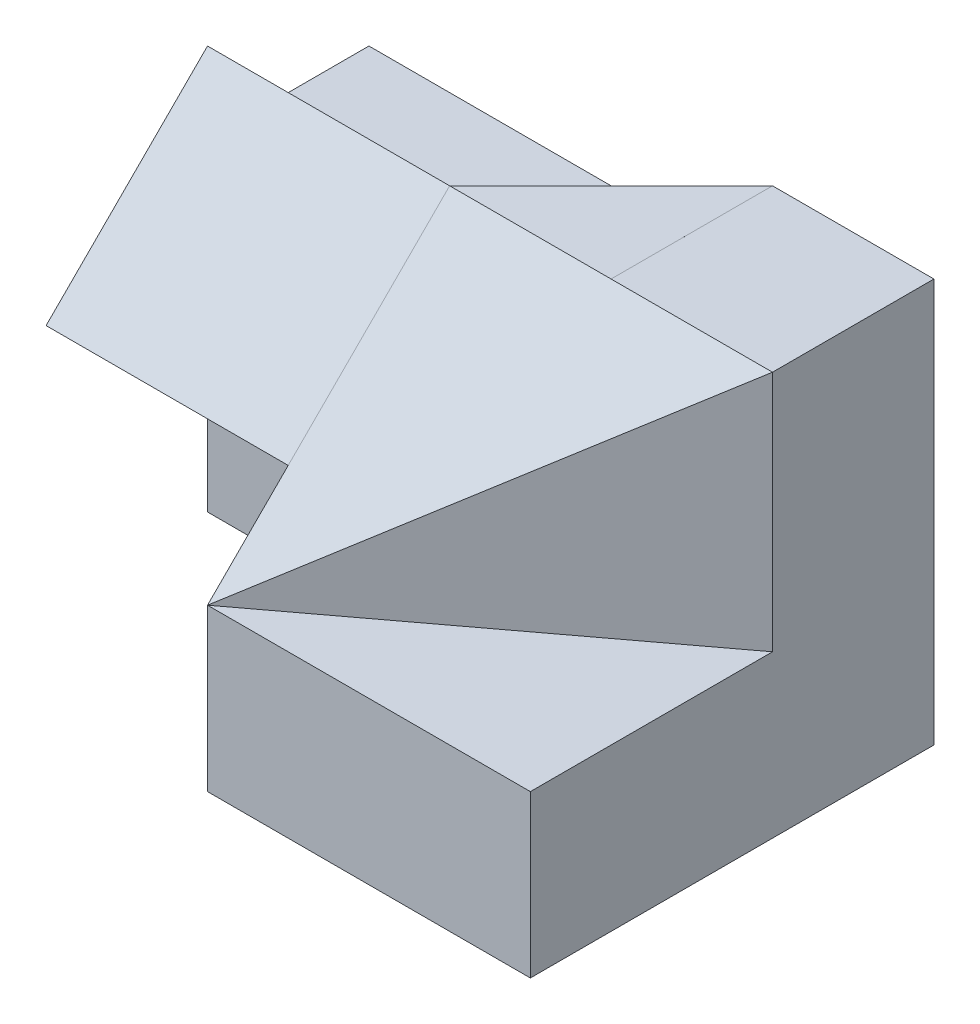
ISO-10303-21;
HEADER;
FILE_DESCRIPTION(('STEP AP214'),'2;1');
FILE_NAME('part.step','',(''),(''),'','','');
FILE_SCHEMA(('AUTOMOTIVE_DESIGN { 1 0 10303 214 1 1 1 1 }'));
ENDSEC;
DATA;
#1=APPLICATION_CONTEXT('core data for automotive mechanical design processes');
#2=APPLICATION_PROTOCOL_DEFINITION('international standard','automotive_design',2000,#1);
#3=PRODUCT_CONTEXT('',#1,'mechanical');
#4=PRODUCT('Part','Part','',(#3));
#5=PRODUCT_RELATED_PRODUCT_CATEGORY('part','',(#4));
#6=PRODUCT_DEFINITION_FORMATION('','',#4);
#7=PRODUCT_DEFINITION_CONTEXT('part definition',#1,'design');
#8=PRODUCT_DEFINITION('design','',#6,#7);
#9=PRODUCT_DEFINITION_SHAPE('','',#8);
#10=(LENGTH_UNIT() NAMED_UNIT(*) SI_UNIT(.MILLI.,.METRE.));
#11=(NAMED_UNIT(*) PLANE_ANGLE_UNIT() SI_UNIT($,.RADIAN.));
#12=(NAMED_UNIT(*) SI_UNIT($,.STERADIAN.) SOLID_ANGLE_UNIT());
#13=UNCERTAINTY_MEASURE_WITH_UNIT(LENGTH_MEASURE(1.E-05),#10,'distance_accuracy_value','');
#14=(GEOMETRIC_REPRESENTATION_CONTEXT(3) GLOBAL_UNCERTAINTY_ASSIGNED_CONTEXT((#13)) GLOBAL_UNIT_ASSIGNED_CONTEXT((#10,
#11,#12)) REPRESENTATION_CONTEXT('',''));
#15=CARTESIAN_POINT('',(0.,0.,0.));
#16=DIRECTION('',(0.,0.,1.));
#17=DIRECTION('',(1.,0.,0.));
#18=AXIS2_PLACEMENT_3D('',#15,#16,#17);
#19=CARTESIAN_POINT('',(83.9999999999885,49.9999136,20.0000000001036));
#20=DIRECTION('',(-1.13136949312756E-06,-0.707106781186095,-0.707106781186095));
#21=DIRECTION('',(0.,0.707106781186547,-0.707106781186548));
#22=AXIS2_PLACEMENT_3D('',#19,#20,#21);
#23=PLANE('',#22);
#24=DIRECTION('',(-0.99999999999872,1.60000000012492E-06,-1.91888977700286E-12));
#25=VECTOR('',#24,1.);
#26=CARTESIAN_POINT('',(83.9999999999885,49.9999136,20.0000000001036));
#27=LINE('',#26,#25);
#28=CARTESIAN_POINT('',(49.9999999999744,49.999968,20.0000000000384));
#29=VERTEX_POINT('',#28);
#30=CARTESIAN_POINT('',(30.0000000000288,49.999995499186,20.0000180032562));
#31=VERTEX_POINT('',#30);
#32=EDGE_CURVE('E269',#29,#31,#27,.T.);
#33=ORIENTED_EDGE('',*,*,#32,.T.);
#34=DIRECTION('',(0.999999999996471,-2.49983611112637E-06,8.99838029894826E-07));
#35=VECTOR('',#34,1.);
#36=CARTESIAN_POINT('',(83.9999999997621,49.9998470055938,20.0000665945098));
#37=LINE('',#36,#35);
#38=CARTESIAN_POINT('',(49.9999760000032,49.999932,20.0000359999952));
#39=VERTEX_POINT('',#38);
#40=EDGE_CURVE('E217',#31,#39,#37,.T.);
#41=ORIENTED_EDGE('',*,*,#40,.T.);
#42=DIRECTION('',(0.4264016187771,0.639601745923878,-0.63960242816565));
#43=VECTOR('',#42,1.);
#44=CARTESIAN_POINT('',(30.,20.,50.));
#45=LINE('',#44,#43);
#46=EDGE_CURVE('E445',#39,#29,#45,.T.);
#47=ORIENTED_EDGE('',*,*,#46,.T.);
#48=EDGE_LOOP('',(#33,#41,#47));
#49=FACE_BOUND('',#48,.T.);
#50=ADVANCED_FACE('F35',(#49),#23,.F.);
#51=CARTESIAN_POINT('',(58.,49.9999,4.));
#52=DIRECTION('',(-1.60000000012608E-06,-0.999999999998,1.19999999992108E-06));
#53=DIRECTION('',(0.99999999999872,-1.60000000012723E-06,0.));
#54=AXIS2_PLACEMENT_3D('',#51,#52,#53);
#55=PLANE('',#54);
#56=DIRECTION('',(0.99999999999872,-1.60000000012723E-06,0.));
#57=VECTOR('',#56,1.);
#58=CARTESIAN_POINT('',(58.0000000000308,49.9999192,20.));
#59=LINE('',#58,#57);
#60=CARTESIAN_POINT('',(50.,49.999932,20.));
#61=VERTEX_POINT('',#60);
#62=CARTESIAN_POINT('',(69.9999999998656,49.9999,20.));
#63=VERTEX_POINT('',#62);
#64=EDGE_CURVE('E243',#61,#63,#59,.T.);
#65=ORIENTED_EDGE('',*,*,#64,.F.);
#66=DIRECTION('',(0.554700196224243,-1.88598066717047E-06,-0.832050294336364));
#67=VECTOR('',#66,1.);
#68=CARTESIAN_POINT('',(30.0000313846154,49.9999999998933,49.9999529230769));
#69=LINE('',#68,#67);
#70=EDGE_CURVE('E280',#39,#61,#69,.T.);
#71=ORIENTED_EDGE('',*,*,#70,.F.);
#72=DIRECTION('',(0.99999999999872,-1.60000000012492E-06,1.91888977687061E-12));
#73=VECTOR('',#72,1.);
#74=CARTESIAN_POINT('',(58.,49.9999192000432,20.0000360000106));
#75=LINE('',#74,#73);
#76=CARTESIAN_POINT('',(69.9999519999553,49.99990000012,20.0000360000336));
#77=VERTEX_POINT('',#76);
#78=EDGE_CURVE('E447',#39,#77,#75,.T.);
#79=ORIENTED_EDGE('',*,*,#78,.T.);
#80=DIRECTION('',(0.7999999999984,-2.00000000005351E-06,-0.5999999999988));
#81=VECTOR('',#80,1.);
#82=CARTESIAN_POINT('',(70.,49.9999,20.));
#83=LINE('',#82,#81);
#84=EDGE_CURVE('E453',#77,#63,#83,.T.);
#85=ORIENTED_EDGE('',*,*,#84,.T.);
#86=EDGE_LOOP('',(#65,#71,#79,#85));
#87=FACE_BOUND('',#86,.T.);
#88=ADVANCED_FACE('F389',(#87),#55,.F.);
#89=ORIENTED_EDGE('',*,*,#78,.F.);
#90=DIRECTION('',(-0.426401618777099,-0.639601745923878,0.63960242816565));
#91=VECTOR('',#90,1.);
#92=CARTESIAN_POINT('',(56.1818087404533,59.2726712198362,10.7272868893201));
#93=LINE('',#92,#91);
#94=CARTESIAN_POINT('',(49.9999546665927,49.9999,20.0000680001109));
#95=VERTEX_POINT('',#94);
#96=EDGE_CURVE('E204',#39,#95,#93,.T.);
#97=ORIENTED_EDGE('',*,*,#96,.T.);
#98=DIRECTION('',(0.99999999999872,0.,-1.59999808123515E-06));
#99=VECTOR('',#98,1.);
#100=CARTESIAN_POINT('',(84.0000000000103,49.9999,20.0000136001036));
#101=LINE('',#100,#99);
#102=CARTESIAN_POINT('',(30.,49.9999,20.0001));
#103=VERTEX_POINT('',#102);
#104=EDGE_CURVE('E196',#103,#95,#101,.T.);
#105=ORIENTED_EDGE('',*,*,#104,.F.);
#106=DIRECTION('',(0.,0.707106781186547,-0.707106781186548));
#107=VECTOR('',#106,1.);
#108=CARTESIAN_POINT('',(30.,35.,35.));
#109=LINE('',#108,#107);
#110=CARTESIAN_POINT('',(30.,44.999997000028,25.000002999972));
#111=VERTEX_POINT('',#110);
#112=EDGE_CURVE('E332',#111,#103,#109,.T.);
#113=ORIENTED_EDGE('',*,*,#112,.F.);
#114=CARTESIAN_POINT('',(29.9999680000192,30.,40.));
#115=DIRECTION('',(1.13137220669536E-06,0.707106781186095,-0.707106781186095));
#116=VECTOR('',#115,1.);
#117=LINE('',#114,#116);
#118=CARTESIAN_POINT('',(29.9999880000072,30.,40.0000000000128));
#119=VERTEX_POINT('',#118);
#120=EDGE_CURVE('E359',#119,#111,#117,.T.);
#121=ORIENTED_EDGE('',*,*,#120,.F.);
#122=DIRECTION('',(0.,-0.707106752938031,0.707106809435063));
#123=VECTOR('',#122,1.);
#124=CARTESIAN_POINT('',(30.,35.000000398484,34.9999976020236));
#125=LINE('',#124,#123);
#126=CARTESIAN_POINT('',(30.,20.,50.));
#127=VERTEX_POINT('',#126);
#128=EDGE_CURVE('E44',#119,#127,#125,.T.);
#129=ORIENTED_EDGE('',*,*,#128,.T.);
#130=DIRECTION('',(0.685994727954525,0.514494948375645,-0.514496045965894));
#131=VECTOR('',#130,1.);
#132=CARTESIAN_POINT('',(26.470599307962,17.3529551280058,52.6470505190286));
#133=LINE('',#132,#131);
#134=EDGE_CURVE('E268',#127,#77,#133,.T.);
#135=ORIENTED_EDGE('',*,*,#134,.T.);
#136=EDGE_LOOP('',(#89,#97,#105,#113,#121,#129,#135));
#137=FACE_BOUND('',#136,.T.);
#138=ADVANCED_FACE('F378',(#137),#23,.F.);
#139=CARTESIAN_POINT('',(0.,0.,50.));
#140=DIRECTION('',(0.,0.,-1.));
#141=DIRECTION('',(-1.,0.,0.));
#142=AXIS2_PLACEMENT_3D('',#139,#140,#141);
#143=PLANE('',#142);
#144=DIRECTION('',(-0.99999999999872,1.60000000012492E-06,-1.91888977700286E-12));
#145=VECTOR('',#144,1.);
#146=CARTESIAN_POINT('',(83.9999519999309,19.9999136000768,50.0000000001036));
#147=LINE('',#146,#145);
#148=CARTESIAN_POINT('',(70.,19.999936,50.0000000000768));
#149=VERTEX_POINT('',#148);
#150=CARTESIAN_POINT('',(31.,19.9999991989908,50.));
#151=VERTEX_POINT('',#150);
#152=EDGE_CURVE('E264',#149,#151,#147,.T.);
#153=ORIENTED_EDGE('',*,*,#152,.T.);
#154=DIRECTION('',(1.,0.,0.));
#155=VECTOR('',#154,1.);
#156=CARTESIAN_POINT('',(1.,19.9999991989908,50.));
#157=LINE('',#156,#155);
#158=EDGE_CURVE('E283',#127,#151,#157,.T.);
#159=ORIENTED_EDGE('',*,*,#158,.F.);
#160=DIRECTION('',(0.,1.,0.));
#161=VECTOR('',#160,1.);
#162=CARTESIAN_POINT('',(30.,0.,50.));
#163=LINE('',#162,#161);
#164=CARTESIAN_POINT('',(30.,0.,50.));
#165=VERTEX_POINT('',#164);
#166=EDGE_CURVE('E245',#165,#127,#163,.T.);
#167=ORIENTED_EDGE('',*,*,#166,.F.);
#168=DIRECTION('',(1.,0.,0.));
#169=VECTOR('',#168,1.);
#170=CARTESIAN_POINT('',(0.,0.,50.));
#171=LINE('',#170,#169);
#172=CARTESIAN_POINT('',(70.,0.,50.));
#173=VERTEX_POINT('',#172);
#174=EDGE_CURVE('E60',#165,#173,#171,.T.);
#175=ORIENTED_EDGE('',*,*,#174,.T.);
#176=DIRECTION('',(0.,1.,0.));
#177=VECTOR('',#176,1.);
#178=CARTESIAN_POINT('',(70.,0.,50.));
#179=LINE('',#178,#177);
#180=EDGE_CURVE('E322',#173,#149,#179,.T.);
#181=ORIENTED_EDGE('',*,*,#180,.T.);
#182=EDGE_LOOP('',(#153,#159,#167,#175,#181));
#183=FACE_BOUND('',#182,.T.);
#184=ADVANCED_FACE('F413',(#183),#143,.F.);
#185=CARTESIAN_POINT('',(30.,20.,20.));
#186=DIRECTION('',(0.,-1.,0.));
#187=DIRECTION('',(0.,0.,-1.));
#188=AXIS2_PLACEMENT_3D('',#185,#186,#187);
#189=PLANE('',#188);
#190=DIRECTION('',(-0.8,0.,0.6));
#191=VECTOR('',#190,1.);
#192=CARTESIAN_POINT('',(30.,20.,50.));
#193=LINE('',#192,#191);
#194=CARTESIAN_POINT('',(70.,20.,20.));
#195=VERTEX_POINT('',#194);
#196=EDGE_CURVE('E457',#195,#127,#193,.T.);
#197=ORIENTED_EDGE('',*,*,#196,.T.);
#198=ORIENTED_EDGE('',*,*,#158,.T.);
#199=DIRECTION('',(0.99999999999872,0.,-1.59999808123515E-06));
#200=VECTOR('',#199,1.);
#201=CARTESIAN_POINT('',(30.0000479999424,20.,49.9999999999232));
#202=LINE('',#201,#200);
#203=CARTESIAN_POINT('',(70.,20.,49.9999360000768));
#204=VERTEX_POINT('',#203);
#205=EDGE_CURVE('E272',#151,#204,#202,.T.);
#206=ORIENTED_EDGE('',*,*,#205,.T.);
#207=DIRECTION('',(0.,0.,1.));
#208=VECTOR('',#207,1.);
#209=CARTESIAN_POINT('',(70.,20.,20.));
#210=LINE('',#209,#208);
#211=EDGE_CURVE('E433',#195,#204,#210,.T.);
#212=ORIENTED_EDGE('',*,*,#211,.F.);
#213=EDGE_LOOP('',(#197,#198,#206,#212));
#214=FACE_BOUND('',#213,.T.);
#215=ADVANCED_FACE('F388',(#214),#189,.F.);
#216=CARTESIAN_POINT('',(34.8,0.,46.4));
#217=DIRECTION('',(0.6,0.,0.8));
#218=DIRECTION('',(0.8,0.,-0.6));
#219=AXIS2_PLACEMENT_3D('',#216,#217,#218);
#220=PLANE('',#219);
#221=ORIENTED_EDGE('',*,*,#134,.F.);
#222=ORIENTED_EDGE('',*,*,#196,.F.);
#223=DIRECTION('',(0.,1.,0.));
#224=VECTOR('',#223,1.);
#225=CARTESIAN_POINT('',(70.,20.,20.));
#226=LINE('',#225,#224);
#227=CARTESIAN_POINT('',(69.9999999997632,49.999836,20.));
#228=VERTEX_POINT('',#227);
#229=EDGE_CURVE('E437',#195,#228,#226,.T.);
#230=ORIENTED_EDGE('',*,*,#229,.T.);
#231=DIRECTION('',(1.60000000012492E-06,0.99999999999872,0.));
#232=VECTOR('',#231,1.);
#233=CARTESIAN_POINT('',(69.9999999997632,49.999836,20.));
#234=LINE('',#233,#232);
#235=EDGE_CURVE('E291',#228,#63,#234,.T.);
#236=ORIENTED_EDGE('',*,*,#235,.T.);
#237=ORIENTED_EDGE('',*,*,#84,.F.);
#238=EDGE_LOOP('',(#221,#222,#230,#236,#237));
#239=FACE_BOUND('',#238,.T.);
#240=ADVANCED_FACE('F384',(#239),#220,.T.);
#241=CARTESIAN_POINT('',(30.,20.,50.));
#242=DIRECTION('',(0.832050294337844,0.,0.554700196225229));
#243=DIRECTION('',(0.554700196225229,0.,-0.832050294337844));
#244=AXIS2_PLACEMENT_3D('',#241,#242,#243);
#245=PLANE('',#244);
#246=DIRECTION('',(0.,1.,0.));
#247=VECTOR('',#246,1.);
#248=CARTESIAN_POINT('',(49.9999760000032,49.9999,20.0000359999952));
#249=LINE('',#248,#247);
#250=CARTESIAN_POINT('',(49.9999760000032,49.9999680000384,20.0000359999952));
#251=VERTEX_POINT('',#250);
#252=CARTESIAN_POINT('',(49.9999760000032,50.,20.0000359999952));
#253=VERTEX_POINT('',#252);
#254=EDGE_CURVE('E209',#251,#253,#249,.T.);
#255=ORIENTED_EDGE('',*,*,#254,.F.);
#256=DIRECTION('',(-0.554700196225011,8.87520314220345E-07,0.832050294337516));
#257=VECTOR('',#256,1.);
#258=CARTESIAN_POINT('',(30.0000147692308,49.9999999999764,49.9999778461538));
#259=LINE('',#258,#257);
#260=EDGE_CURVE('E274',#29,#251,#259,.T.);
#261=ORIENTED_EDGE('',*,*,#260,.F.);
#262=DIRECTION('',(0.,1.,0.));
#263=VECTOR('',#262,1.);
#264=CARTESIAN_POINT('',(50.,49.9999,20.));
#265=LINE('',#264,#263);
#266=CARTESIAN_POINT('',(50.,50.,20.));
#267=VERTEX_POINT('',#266);
#268=EDGE_CURVE('E465',#29,#267,#265,.T.);
#269=ORIENTED_EDGE('',*,*,#268,.T.);
#270=DIRECTION('',(0.554700196225229,0.,-0.832050294337844));
#271=VECTOR('',#270,1.);
#272=CARTESIAN_POINT('',(30.,50.,50.));
#273=LINE('',#272,#271);
#274=EDGE_CURVE('E336',#253,#267,#273,.T.);
#275=ORIENTED_EDGE('',*,*,#274,.F.);
#276=EDGE_LOOP('',(#255,#261,#269,#275));
#277=FACE_BOUND('',#276,.T.);
#278=ADVANCED_FACE('F387',(#277),#245,.T.);
#279=CARTESIAN_POINT('',(91.,35.,35.));
#280=DIRECTION('',(0.,-0.707106781186548,-0.707106781186547));
#281=DIRECTION('',(0.,0.707106781186547,-0.707106781186548));
#282=AXIS2_PLACEMENT_3D('',#279,#280,#281);
#283=PLANE('',#282);
#284=DIRECTION('',(-1.,0.,0.));
#285=VECTOR('',#284,1.);
#286=CARTESIAN_POINT('',(0.,30.,40.));
#287=LINE('',#286,#285);
#288=CARTESIAN_POINT('',(0.,30.,40.));
#289=VERTEX_POINT('',#288);
#290=EDGE_CURVE('E421',#119,#289,#287,.T.);
#291=ORIENTED_EDGE('',*,*,#290,.F.);
#292=ORIENTED_EDGE('',*,*,#120,.T.);
#293=ORIENTED_EDGE('',*,*,#112,.T.);
#294=DIRECTION('',(6.77838760424214E-13,0.707106781186547,-0.707106781186548));
#295=VECTOR('',#294,1.);
#296=CARTESIAN_POINT('',(30.0000000000144,35.0000000000293,34.9999999999708));
#297=LINE('',#296,#295);
#298=EDGE_CURVE('E225',#103,#31,#297,.T.);
#299=ORIENTED_EDGE('',*,*,#298,.T.);
#300=DIRECTION('',(1.,0.,0.));
#301=VECTOR('',#300,1.);
#302=CARTESIAN_POINT('',(0.,50.,20.));
#303=LINE('',#302,#301);
#304=CARTESIAN_POINT('',(0.,50.,20.));
#305=VERTEX_POINT('',#304);
#306=EDGE_CURVE('E343',#305,#31,#303,.T.);
#307=ORIENTED_EDGE('',*,*,#306,.F.);
#308=DIRECTION('',(0.,-0.707106781186547,0.707106781186548));
#309=VECTOR('',#308,1.);
#310=CARTESIAN_POINT('',(0.,35.,35.));
#311=LINE('',#310,#309);
#312=EDGE_CURVE('E427',#305,#289,#311,.T.);
#313=ORIENTED_EDGE('',*,*,#312,.T.);
#314=EDGE_LOOP('',(#291,#292,#293,#299,#307,#313));
#315=FACE_BOUND('',#314,.T.);
#316=ADVANCED_FACE('F400',(#315),#283,.F.);
#317=CARTESIAN_POINT('',(50.,49.9999,0.));
#318=DIRECTION('',(-1.,0.,0.));
#319=DIRECTION('',(0.,0.,1.));
#320=AXIS2_PLACEMENT_3D('',#317,#318,#319);
#321=PLANE('',#320);
#322=EDGE_CURVE('E347',#61,#29,#265,.T.);
#323=ORIENTED_EDGE('',*,*,#322,.F.);
#324=DIRECTION('',(1.60000000012492E-06,0.99999999999872,0.));
#325=VECTOR('',#324,1.);
#326=CARTESIAN_POINT('',(49.9999999997888,49.999868,20.));
#327=LINE('',#326,#325);
#328=CARTESIAN_POINT('',(49.9999999997888,49.999868,20.));
#329=VERTEX_POINT('',#328);
#330=EDGE_CURVE('E51',#329,#61,#327,.T.);
#331=ORIENTED_EDGE('',*,*,#330,.F.);
#332=DIRECTION('',(0.,0.,-1.));
#333=VECTOR('',#332,1.);
#334=CARTESIAN_POINT('',(49.9999999997888,49.999868,20.));
#335=LINE('',#334,#333);
#336=CARTESIAN_POINT('',(49.9999999997888,49.999868,0.));
#337=VERTEX_POINT('',#336);
#338=EDGE_CURVE('E234',#329,#337,#335,.T.);
#339=ORIENTED_EDGE('',*,*,#338,.T.);
#340=DIRECTION('',(0.,1.,0.));
#341=VECTOR('',#340,1.);
#342=CARTESIAN_POINT('',(50.,49.9999,0.));
#343=LINE('',#342,#341);
#344=CARTESIAN_POINT('',(50.,50.,0.));
#345=VERTEX_POINT('',#344);
#346=EDGE_CURVE('E462',#337,#345,#343,.T.);
#347=ORIENTED_EDGE('',*,*,#346,.T.);
#348=DIRECTION('',(0.,0.,1.));
#349=VECTOR('',#348,1.);
#350=CARTESIAN_POINT('',(50.,50.,0.));
#351=LINE('',#350,#349);
#352=EDGE_CURVE('E335',#345,#267,#351,.T.);
#353=ORIENTED_EDGE('',*,*,#352,.T.);
#354=ORIENTED_EDGE('',*,*,#268,.F.);
#355=EDGE_LOOP('',(#323,#331,#339,#347,#353,#354));
#356=FACE_BOUND('',#355,.T.);
#357=ADVANCED_FACE('F396',(#356),#321,.F.);
#358=ORIENTED_EDGE('',*,*,#46,.F.);
#359=ORIENTED_EDGE('',*,*,#70,.T.);
#360=ORIENTED_EDGE('',*,*,#322,.T.);
#361=EDGE_LOOP('',(#358,#359,#360));
#362=FACE_BOUND('',#361,.T.);
#363=ADVANCED_FACE('F393',(#362),#245,.T.);
#364=CARTESIAN_POINT('',(0.,0.,50.));
#365=DIRECTION('',(1.,0.,0.));
#366=DIRECTION('',(0.,0.,-1.));
#367=AXIS2_PLACEMENT_3D('',#364,#365,#366);
#368=PLANE('',#367);
#369=DIRECTION('',(0.,0.,-1.));
#370=VECTOR('',#369,1.);
#371=CARTESIAN_POINT('',(0.,0.,50.));
#372=LINE('',#371,#370);
#373=CARTESIAN_POINT('',(0.,0.,20.));
#374=VERTEX_POINT('',#373);
#375=CARTESIAN_POINT('',(0.,0.,0.));
#376=VERTEX_POINT('',#375);
#377=EDGE_CURVE('E72',#374,#376,#372,.T.);
#378=ORIENTED_EDGE('',*,*,#377,.F.);
#379=DIRECTION('',(0.,-1.,0.));
#380=VECTOR('',#379,1.);
#381=CARTESIAN_POINT('',(0.,0.,20.));
#382=LINE('',#381,#380);
#383=CARTESIAN_POINT('',(0.,30.,20.));
#384=VERTEX_POINT('',#383);
#385=EDGE_CURVE('E249',#384,#374,#382,.T.);
#386=ORIENTED_EDGE('',*,*,#385,.F.);
#387=DIRECTION('',(0.,0.,-1.));
#388=VECTOR('',#387,1.);
#389=CARTESIAN_POINT('',(0.,30.,50.));
#390=LINE('',#389,#388);
#391=EDGE_CURVE('E285',#289,#384,#390,.T.);
#392=ORIENTED_EDGE('',*,*,#391,.F.);
#393=ORIENTED_EDGE('',*,*,#312,.F.);
#394=DIRECTION('',(0.,1.,0.));
#395=VECTOR('',#394,1.);
#396=CARTESIAN_POINT('',(0.,40.,20.));
#397=LINE('',#396,#395);
#398=CARTESIAN_POINT('',(0.,40.,20.));
#399=VERTEX_POINT('',#398);
#400=EDGE_CURVE('E80',#399,#305,#397,.T.);
#401=ORIENTED_EDGE('',*,*,#400,.F.);
#402=DIRECTION('',(0.,0.,1.));
#403=VECTOR('',#402,1.);
#404=CARTESIAN_POINT('',(0.,40.,0.));
#405=LINE('',#404,#403);
#406=CARTESIAN_POINT('',(0.,40.,0.));
#407=VERTEX_POINT('',#406);
#408=EDGE_CURVE('E342',#407,#399,#405,.T.);
#409=ORIENTED_EDGE('',*,*,#408,.F.);
#410=DIRECTION('',(0.,-1.,0.));
#411=VECTOR('',#410,1.);
#412=CARTESIAN_POINT('',(0.,0.,0.));
#413=LINE('',#412,#411);
#414=EDGE_CURVE('E324',#407,#376,#413,.T.);
#415=ORIENTED_EDGE('',*,*,#414,.T.);
#416=EDGE_LOOP('',(#378,#386,#392,#393,#401,#409,#415));
#417=FACE_BOUND('',#416,.T.);
#418=ADVANCED_FACE('F37',(#417),#368,.F.);
#419=CARTESIAN_POINT('',(0.,0.,50.));
#420=DIRECTION('',(0.,1.,0.));
#421=DIRECTION('',(0.,0.,1.));
#422=AXIS2_PLACEMENT_3D('',#419,#420,#421);
#423=PLANE('',#422);
#424=DIRECTION('',(0.,0.,1.));
#425=VECTOR('',#424,1.);
#426=CARTESIAN_POINT('',(30.,0.,50.));
#427=LINE('',#426,#425);
#428=CARTESIAN_POINT('',(30.,0.,20.));
#429=VERTEX_POINT('',#428);
#430=EDGE_CURVE('E481',#429,#165,#427,.T.);
#431=ORIENTED_EDGE('',*,*,#430,.F.);
#432=DIRECTION('',(-1.,0.,0.));
#433=VECTOR('',#432,1.);
#434=CARTESIAN_POINT('',(30.,0.,20.));
#435=LINE('',#434,#433);
#436=EDGE_CURVE('E484',#429,#374,#435,.T.);
#437=ORIENTED_EDGE('',*,*,#436,.T.);
#438=ORIENTED_EDGE('',*,*,#377,.T.);
#439=DIRECTION('',(1.,0.,0.));
#440=VECTOR('',#439,1.);
#441=CARTESIAN_POINT('',(0.,0.,0.));
#442=LINE('',#441,#440);
#443=CARTESIAN_POINT('',(70.,0.,0.));
#444=VERTEX_POINT('',#443);
#445=EDGE_CURVE('E320',#376,#444,#442,.T.);
#446=ORIENTED_EDGE('',*,*,#445,.T.);
#447=DIRECTION('',(0.,0.,-1.));
#448=VECTOR('',#447,1.);
#449=CARTESIAN_POINT('',(70.,0.,50.));
#450=LINE('',#449,#448);
#451=EDGE_CURVE('E319',#173,#444,#450,.T.);
#452=ORIENTED_EDGE('',*,*,#451,.F.);
#453=ORIENTED_EDGE('',*,*,#174,.F.);
#454=EDGE_LOOP('',(#431,#437,#438,#446,#452,#453));
#455=FACE_BOUND('',#454,.T.);
#456=ADVANCED_FACE('F565',(#455),#423,.F.);
#457=CARTESIAN_POINT('',(70.,0.,50.));
#458=DIRECTION('',(-1.,0.,0.));
#459=DIRECTION('',(0.,0.,1.));
#460=AXIS2_PLACEMENT_3D('',#457,#458,#459);
#461=PLANE('',#460);
#462=DIRECTION('',(0.,1.,0.));
#463=VECTOR('',#462,1.);
#464=CARTESIAN_POINT('',(70.,0.,0.));
#465=LINE('',#464,#463);
#466=CARTESIAN_POINT('',(69.9999999998976,49.999836,0.));
#467=VERTEX_POINT('',#466);
#468=EDGE_CURVE('E312',#444,#467,#465,.T.);
#469=ORIENTED_EDGE('',*,*,#468,.T.);
#470=DIRECTION('',(-6.71962485654376E-12,0.,1.));
#471=VECTOR('',#470,1.);
#472=CARTESIAN_POINT('',(69.9999999997632,49.999836,20.));
#473=LINE('',#472,#471);
#474=EDGE_CURVE('E300',#467,#228,#473,.T.);
#475=ORIENTED_EDGE('',*,*,#474,.T.);
#476=ORIENTED_EDGE('',*,*,#229,.F.);
#477=ORIENTED_EDGE('',*,*,#211,.T.);
#478=DIRECTION('',(0.,-0.707106781186547,0.707106781186548));
#479=VECTOR('',#478,1.);
#480=CARTESIAN_POINT('',(70.,9.99996800003841,59.9999680000384));
#481=LINE('',#480,#479);
#482=EDGE_CURVE('E275',#204,#149,#481,.T.);
#483=ORIENTED_EDGE('',*,*,#482,.T.);
#484=ORIENTED_EDGE('',*,*,#180,.F.);
#485=ORIENTED_EDGE('',*,*,#451,.T.);
#486=EDGE_LOOP('',(#469,#475,#476,#477,#483,#484,#485));
#487=FACE_BOUND('',#486,.T.);
#488=ADVANCED_FACE('F317',(#487),#461,.F.);
#489=CARTESIAN_POINT('',(0.,50.,50.));
#490=DIRECTION('',(0.,-1.,0.));
#491=DIRECTION('',(0.,0.,-1.));
#492=AXIS2_PLACEMENT_3D('',#489,#490,#491);
#493=PLANE('',#492);
#494=DIRECTION('',(0.707106781186548,0.,-0.707106781186548));
#495=VECTOR('',#494,1.);
#496=CARTESIAN_POINT('',(25.,50.,25.));
#497=LINE('',#496,#495);
#498=EDGE_CURVE('E339',#31,#345,#497,.T.);
#499=ORIENTED_EDGE('',*,*,#498,.F.);
#500=DIRECTION('',(-0.999999999999595,0.,-8.99838029897638E-07));
#501=VECTOR('',#500,1.);
#502=CARTESIAN_POINT('',(30.0000000000288,50.,20.0000180032562));
#503=LINE('',#502,#501);
#504=EDGE_CURVE('E199',#253,#31,#503,.T.);
#505=ORIENTED_EDGE('',*,*,#504,.F.);
#506=ORIENTED_EDGE('',*,*,#274,.T.);
#507=ORIENTED_EDGE('',*,*,#352,.F.);
#508=EDGE_LOOP('',(#499,#505,#506,#507));
#509=FACE_BOUND('',#508,.T.);
#510=ADVANCED_FACE('F500',(#509),#493,.F.);
#511=CARTESIAN_POINT('',(0.,0.,0.));
#512=DIRECTION('',(0.,0.,-1.));
#513=DIRECTION('',(-1.,0.,0.));
#514=AXIS2_PLACEMENT_3D('',#511,#512,#513);
#515=PLANE('',#514);
#516=DIRECTION('',(0.99999999999872,-1.60000000018791E-06,0.));
#517=VECTOR('',#516,1.);
#518=CARTESIAN_POINT('',(49.9999999997888,49.999868,0.));
#519=LINE('',#518,#517);
#520=EDGE_CURVE('E237',#337,#467,#519,.T.);
#521=ORIENTED_EDGE('',*,*,#520,.T.);
#522=ORIENTED_EDGE('',*,*,#468,.F.);
#523=ORIENTED_EDGE('',*,*,#445,.F.);
#524=ORIENTED_EDGE('',*,*,#414,.F.);
#525=DIRECTION('',(-1.,0.,0.));
#526=VECTOR('',#525,1.);
#527=CARTESIAN_POINT('',(0.,40.,0.));
#528=LINE('',#527,#526);
#529=CARTESIAN_POINT('',(50.,40.,0.));
#530=VERTEX_POINT('',#529);
#531=EDGE_CURVE('E88',#530,#407,#528,.T.);
#532=ORIENTED_EDGE('',*,*,#531,.F.);
#533=DIRECTION('',(0.,1.,0.));
#534=VECTOR('',#533,1.);
#535=CARTESIAN_POINT('',(50.,40.,0.));
#536=LINE('',#535,#534);
#537=EDGE_CURVE('E313',#530,#337,#536,.T.);
#538=ORIENTED_EDGE('',*,*,#537,.T.);
#539=EDGE_LOOP('',(#521,#522,#523,#524,#532,#538));
#540=FACE_BOUND('',#539,.T.);
#541=ADVANCED_FACE('F310',(#540),#515,.T.);
#542=CARTESIAN_POINT('',(25.,40.,25.));
#543=DIRECTION('',(0.707106781186548,0.,0.707106781186548));
#544=DIRECTION('',(0.707106781186548,0.,-0.707106781186548));
#545=AXIS2_PLACEMENT_3D('',#542,#543,#544);
#546=PLANE('',#545);
#547=ORIENTED_EDGE('',*,*,#498,.T.);
#548=ORIENTED_EDGE('',*,*,#346,.F.);
#549=ORIENTED_EDGE('',*,*,#537,.F.);
#550=DIRECTION('',(0.707106781186548,0.,-0.707106781186548));
#551=VECTOR('',#550,1.);
#552=CARTESIAN_POINT('',(25.,40.,25.));
#553=LINE('',#552,#551);
#554=CARTESIAN_POINT('',(30.,40.,20.));
#555=VERTEX_POINT('',#554);
#556=EDGE_CURVE('E471',#555,#530,#553,.T.);
#557=ORIENTED_EDGE('',*,*,#556,.F.);
#558=DIRECTION('',(0.,1.,0.));
#559=VECTOR('',#558,1.);
#560=CARTESIAN_POINT('',(30.,40.,20.));
#561=LINE('',#560,#559);
#562=EDGE_CURVE('E350',#555,#31,#561,.T.);
#563=ORIENTED_EDGE('',*,*,#562,.T.);
#564=EDGE_LOOP('',(#547,#548,#549,#557,#563));
#565=FACE_BOUND('',#564,.T.);
#566=ADVANCED_FACE('F405',(#565),#546,.F.);
#567=CARTESIAN_POINT('',(0.,40.,20.));
#568=DIRECTION('',(0.,0.,1.));
#569=DIRECTION('',(1.,0.,0.));
#570=AXIS2_PLACEMENT_3D('',#567,#568,#569);
#571=PLANE('',#570);
#572=ORIENTED_EDGE('',*,*,#306,.T.);
#573=ORIENTED_EDGE('',*,*,#562,.F.);
#574=DIRECTION('',(1.,0.,0.));
#575=VECTOR('',#574,1.);
#576=CARTESIAN_POINT('',(0.,40.,20.));
#577=LINE('',#576,#575);
#578=EDGE_CURVE('E468',#399,#555,#577,.T.);
#579=ORIENTED_EDGE('',*,*,#578,.F.);
#580=ORIENTED_EDGE('',*,*,#400,.T.);
#581=EDGE_LOOP('',(#572,#573,#579,#580));
#582=FACE_BOUND('',#581,.T.);
#583=ADVANCED_FACE('F404',(#582),#571,.F.);
#584=CARTESIAN_POINT('',(0.,40.,0.));
#585=DIRECTION('',(0.,1.,0.));
#586=DIRECTION('',(0.,0.,1.));
#587=AXIS2_PLACEMENT_3D('',#584,#585,#586);
#588=PLANE('',#587);
#589=ORIENTED_EDGE('',*,*,#408,.T.);
#590=ORIENTED_EDGE('',*,*,#578,.T.);
#591=ORIENTED_EDGE('',*,*,#556,.T.);
#592=ORIENTED_EDGE('',*,*,#531,.T.);
#593=EDGE_LOOP('',(#589,#590,#591,#592));
#594=FACE_BOUND('',#593,.T.);
#595=ADVANCED_FACE('F382',(#594),#588,.T.);
#596=CARTESIAN_POINT('',(83.9999999999309,49.9999136,50.0000000001036));
#597=DIRECTION('',(1.60000000012492E-06,0.99999999999872,0.));
#598=DIRECTION('',(-0.99999999999872,1.60000000012492E-06,0.));
#599=AXIS2_PLACEMENT_3D('',#596,#597,#598);
#600=PLANE('',#599);
#601=ORIENTED_EDGE('',*,*,#260,.T.);
#602=DIRECTION('',(-0.999999999998315,1.60000000012428E-06,-8.99838029896486E-07));
#603=VECTOR('',#602,1.);
#604=CARTESIAN_POINT('',(84.0000269950119,49.9999135999568,20.0000665945341));
#605=LINE('',#604,#603);
#606=EDGE_CURVE('E11',#251,#31,#605,.T.);
#607=ORIENTED_EDGE('',*,*,#606,.T.);
#608=ORIENTED_EDGE('',*,*,#32,.F.);
#609=EDGE_LOOP('',(#601,#607,#608));
#610=FACE_BOUND('',#609,.T.);
#611=ADVANCED_FACE('F376',(#610),#600,.F.);
#612=ORIENTED_EDGE('',*,*,#152,.F.);
#613=ORIENTED_EDGE('',*,*,#482,.F.);
#614=ORIENTED_EDGE('',*,*,#205,.F.);
#615=EDGE_LOOP('',(#612,#613,#614));
#616=FACE_BOUND('',#615,.T.);
#617=ADVANCED_FACE('F365',(#616),#23,.F.);
#618=CARTESIAN_POINT('',(30.,30.,50.));
#619=DIRECTION('',(0.,1.,0.));
#620=DIRECTION('',(0.,0.,1.));
#621=AXIS2_PLACEMENT_3D('',#618,#619,#620);
#622=PLANE('',#621);
#623=ORIENTED_EDGE('',*,*,#391,.T.);
#624=DIRECTION('',(-1.,0.,0.));
#625=VECTOR('',#624,1.);
#626=CARTESIAN_POINT('',(30.,30.,20.));
#627=LINE('',#626,#625);
#628=CARTESIAN_POINT('',(30.,30.,20.));
#629=VERTEX_POINT('',#628);
#630=EDGE_CURVE('E257',#629,#384,#627,.T.);
#631=ORIENTED_EDGE('',*,*,#630,.F.);
#632=DIRECTION('',(0.,0.,-1.));
#633=VECTOR('',#632,1.);
#634=CARTESIAN_POINT('',(30.,30.,50.));
#635=LINE('',#634,#633);
#636=EDGE_CURVE('E248',#119,#629,#635,.T.);
#637=ORIENTED_EDGE('',*,*,#636,.F.);
#638=ORIENTED_EDGE('',*,*,#290,.T.);
#639=EDGE_LOOP('',(#623,#631,#637,#638));
#640=FACE_BOUND('',#639,.T.);
#641=ADVANCED_FACE('F375',(#640),#622,.F.);
#642=CARTESIAN_POINT('',(30.,0.,20.));
#643=DIRECTION('',(0.,0.,-1.));
#644=DIRECTION('',(-1.,0.,0.));
#645=AXIS2_PLACEMENT_3D('',#642,#643,#644);
#646=PLANE('',#645);
#647=ORIENTED_EDGE('',*,*,#385,.T.);
#648=ORIENTED_EDGE('',*,*,#436,.F.);
#649=DIRECTION('',(0.,-1.,0.));
#650=VECTOR('',#649,1.);
#651=CARTESIAN_POINT('',(30.,0.,20.));
#652=LINE('',#651,#650);
#653=EDGE_CURVE('E252',#629,#429,#652,.T.);
#654=ORIENTED_EDGE('',*,*,#653,.F.);
#655=ORIENTED_EDGE('',*,*,#630,.T.);
#656=EDGE_LOOP('',(#647,#648,#654,#655));
#657=FACE_BOUND('',#656,.T.);
#658=ADVANCED_FACE('F612',(#657),#646,.F.);
#659=CARTESIAN_POINT('',(30.,0.,0.));
#660=DIRECTION('',(-1.,0.,0.));
#661=DIRECTION('',(0.,0.,1.));
#662=AXIS2_PLACEMENT_3D('',#659,#660,#661);
#663=PLANE('',#662);
#664=ORIENTED_EDGE('',*,*,#128,.F.);
#665=ORIENTED_EDGE('',*,*,#636,.T.);
#666=ORIENTED_EDGE('',*,*,#653,.T.);
#667=ORIENTED_EDGE('',*,*,#430,.T.);
#668=ORIENTED_EDGE('',*,*,#166,.T.);
#669=EDGE_LOOP('',(#664,#665,#666,#667,#668));
#670=FACE_BOUND('',#669,.T.);
#671=ADVANCED_FACE('F478',(#670),#663,.T.);
#672=CARTESIAN_POINT('',(49.9999999997888,49.999868,20.));
#673=DIRECTION('',(0.,0.,-1.));
#674=DIRECTION('',(0.,1.,0.));
#675=AXIS2_PLACEMENT_3D('',#672,#673,#674);
#676=PLANE('',#675);
#677=ORIENTED_EDGE('',*,*,#64,.T.);
#678=ORIENTED_EDGE('',*,*,#235,.F.);
#679=DIRECTION('',(-0.99999999999872,1.59999999985172E-06,0.));
#680=VECTOR('',#679,1.);
#681=CARTESIAN_POINT('',(49.9999999997888,49.999868,20.));
#682=LINE('',#681,#680);
#683=EDGE_CURVE('E297',#228,#329,#682,.T.);
#684=ORIENTED_EDGE('',*,*,#683,.T.);
#685=ORIENTED_EDGE('',*,*,#330,.T.);
#686=EDGE_LOOP('',(#677,#678,#684,#685));
#687=FACE_BOUND('',#686,.T.);
#688=ADVANCED_FACE('F515',(#687),#676,.T.);
#689=CARTESIAN_POINT('',(7.99999168092933E-05,49.9999479998721,0.));
#690=DIRECTION('',(-1.60000000018791E-06,-0.99999999999872,0.));
#691=DIRECTION('',(0.99999999999872,-1.60000000018791E-06,0.));
#692=AXIS2_PLACEMENT_3D('',#689,#690,#691);
#693=PLANE('',#692);
#694=ORIENTED_EDGE('',*,*,#338,.F.);
#695=ORIENTED_EDGE('',*,*,#683,.F.);
#696=ORIENTED_EDGE('',*,*,#474,.F.);
#697=ORIENTED_EDGE('',*,*,#520,.F.);
#698=EDGE_LOOP('',(#694,#695,#696,#697));
#699=FACE_BOUND('',#698,.T.);
#700=ADVANCED_FACE('F508',(#699),#693,.F.);
#701=CARTESIAN_POINT('',(30.0000000000288,49.9999,20.0000180032562));
#702=DIRECTION('',(8.99838029897638E-07,0.,-0.999999999999595));
#703=DIRECTION('',(-0.999999999999595,0.,-8.99838029897638E-07));
#704=AXIS2_PLACEMENT_3D('',#701,#702,#703);
#705=PLANE('',#704);
#706=ORIENTED_EDGE('',*,*,#254,.T.);
#707=ORIENTED_EDGE('',*,*,#504,.T.);
#708=ORIENTED_EDGE('',*,*,#606,.F.);
#709=EDGE_LOOP('',(#706,#707,#708));
#710=FACE_BOUND('',#709,.T.);
#711=ADVANCED_FACE('F506',(#710),#705,.F.);
#712=CARTESIAN_POINT('',(0.,49.9999,0.));
#713=DIRECTION('',(0.,1.,0.));
#714=DIRECTION('',(0.,0.,1.));
#715=AXIS2_PLACEMENT_3D('',#712,#713,#714);
#716=PLANE('',#715);
#717=ORIENTED_EDGE('',*,*,#104,.T.);
#718=DIRECTION('',(0.554700196225228,0.,-0.832050294337844));
#719=VECTOR('',#718,1.);
#720=CARTESIAN_POINT('',(49.9999760000032,49.9999,20.0000359999952));
#721=LINE('',#720,#719);
#722=CARTESIAN_POINT('',(49.9999760000032,49.9999,20.0000359999952));
#723=VERTEX_POINT('',#722);
#724=EDGE_CURVE('E188',#95,#723,#721,.T.);
#725=ORIENTED_EDGE('',*,*,#724,.T.);
#726=DIRECTION('',(-0.999999999999595,0.,-8.99838029897638E-07));
#727=VECTOR('',#726,1.);
#728=CARTESIAN_POINT('',(30.0000000000288,49.9999,20.0000180032562));
#729=LINE('',#728,#727);
#730=CARTESIAN_POINT('',(30.0000000000288,49.9999,20.0000180032562));
#731=VERTEX_POINT('',#730);
#732=EDGE_CURVE('E193',#723,#731,#729,.T.);
#733=ORIENTED_EDGE('',*,*,#732,.T.);
#734=DIRECTION('',(-9.58608768094091E-13,0.,1.));
#735=VECTOR('',#734,1.);
#736=CARTESIAN_POINT('',(30.,49.9999,50.));
#737=LINE('',#736,#735);
#738=EDGE_CURVE('E212',#731,#103,#737,.T.);
#739=ORIENTED_EDGE('',*,*,#738,.T.);
#740=EDGE_LOOP('',(#717,#725,#733,#739));
#741=FACE_BOUND('',#740,.T.);
#742=ADVANCED_FACE('F190',(#741),#716,.T.);
#743=CARTESIAN_POINT('',(49.9999760000032,49.9999,20.0000359999952));
#744=DIRECTION('',(0.832050294337844,0.,0.554700196225228));
#745=DIRECTION('',(0.554700196225228,0.,-0.832050294337844));
#746=AXIS2_PLACEMENT_3D('',#743,#744,#745);
#747=PLANE('',#746);
#748=EDGE_CURVE('E202',#723,#39,#249,.T.);
#749=ORIENTED_EDGE('',*,*,#748,.F.);
#750=ORIENTED_EDGE('',*,*,#724,.F.);
#751=ORIENTED_EDGE('',*,*,#96,.F.);
#752=EDGE_LOOP('',(#749,#750,#751));
#753=FACE_BOUND('',#752,.T.);
#754=ADVANCED_FACE('F203',(#753),#747,.F.);
#755=CARTESIAN_POINT('',(30.,49.9999,50.));
#756=DIRECTION('',(-1.,0.,-9.58608768094091E-13));
#757=DIRECTION('',(-9.58608768094091E-13,0.,1.));
#758=AXIS2_PLACEMENT_3D('',#755,#756,#757);
#759=PLANE('',#758);
#760=ORIENTED_EDGE('',*,*,#738,.F.);
#761=DIRECTION('',(0.,1.,0.));
#762=VECTOR('',#761,1.);
#763=CARTESIAN_POINT('',(30.0000000000288,49.9999,20.0000180032562));
#764=LINE('',#763,#762);
#765=EDGE_CURVE('E208',#731,#31,#764,.T.);
#766=ORIENTED_EDGE('',*,*,#765,.T.);
#767=ORIENTED_EDGE('',*,*,#298,.F.);
#768=EDGE_LOOP('',(#760,#766,#767));
#769=FACE_BOUND('',#768,.T.);
#770=ADVANCED_FACE('F504',(#769),#759,.F.);
#771=ORIENTED_EDGE('',*,*,#765,.F.);
#772=ORIENTED_EDGE('',*,*,#732,.F.);
#773=ORIENTED_EDGE('',*,*,#748,.T.);
#774=ORIENTED_EDGE('',*,*,#40,.F.);
#775=EDGE_LOOP('',(#771,#772,#773,#774));
#776=FACE_BOUND('',#775,.T.);
#777=ADVANCED_FACE('F211',(#776),#705,.F.);
#778=CLOSED_SHELL('',(#50,#88,#138,#184,#215,#240,#278,#316,#357,#363,#418,#456,#488,#510,#541,
#566,#583,#595,#611,#617,#641,#658,#671,#688,#700,#711,#742,#754,#770,#777));
#779=MANIFOLD_SOLID_BREP('B2',#778);
#780=ADVANCED_BREP_SHAPE_REPRESENTATION('',(#18,#779),#14);
#781=SHAPE_DEFINITION_REPRESENTATION(#9,#780);
ENDSEC;
END-ISO-10303-21;
